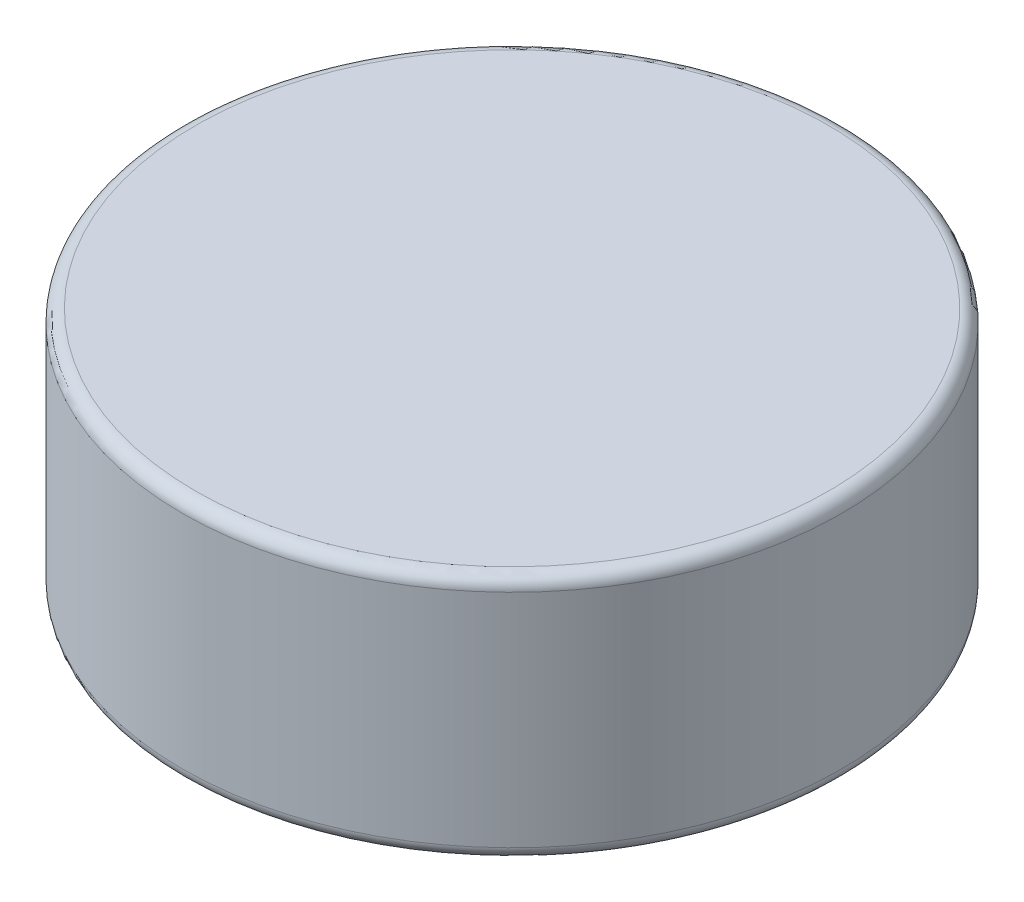
ISO-10303-21;
HEADER;
FILE_DESCRIPTION(('STEP AP214'),'2;1');
FILE_NAME('part.step','',(''),(''),'','','');
FILE_SCHEMA(('AUTOMOTIVE_DESIGN { 1 0 10303 214 1 1 1 1 }'));
ENDSEC;
DATA;
#1=APPLICATION_CONTEXT('core data for automotive mechanical design processes');
#2=APPLICATION_PROTOCOL_DEFINITION('international standard','automotive_design',2000,#1);
#3=PRODUCT_CONTEXT('',#1,'mechanical');
#4=PRODUCT('Part','Part','',(#3));
#5=PRODUCT_RELATED_PRODUCT_CATEGORY('part','',(#4));
#6=PRODUCT_DEFINITION_FORMATION('','',#4);
#7=PRODUCT_DEFINITION_CONTEXT('part definition',#1,'design');
#8=PRODUCT_DEFINITION('design','',#6,#7);
#9=PRODUCT_DEFINITION_SHAPE('','',#8);
#10=(LENGTH_UNIT() NAMED_UNIT(*) SI_UNIT(.MILLI.,.METRE.));
#11=(NAMED_UNIT(*) PLANE_ANGLE_UNIT() SI_UNIT($,.RADIAN.));
#12=(NAMED_UNIT(*) SI_UNIT($,.STERADIAN.) SOLID_ANGLE_UNIT());
#13=UNCERTAINTY_MEASURE_WITH_UNIT(LENGTH_MEASURE(1.E-05),#10,'distance_accuracy_value','');
#14=(GEOMETRIC_REPRESENTATION_CONTEXT(3) GLOBAL_UNCERTAINTY_ASSIGNED_CONTEXT((#13)) GLOBAL_UNIT_ASSIGNED_CONTEXT((#10,
#11,#12)) REPRESENTATION_CONTEXT('',''));
#15=CARTESIAN_POINT('',(0.,0.,0.));
#16=DIRECTION('',(0.,0.,1.));
#17=DIRECTION('',(1.,0.,0.));
#18=AXIS2_PLACEMENT_3D('',#15,#16,#17);
#19=CARTESIAN_POINT('',(0.,4.7625,0.));
#20=DIRECTION('',(0.,-1.,0.));
#21=DIRECTION('',(0.,0.,-1.));
#22=AXIS2_PLACEMENT_3D('',#19,#20,#21);
#23=CYLINDRICAL_SURFACE('',#22,12.7);
#24=CARTESIAN_POINT('',(0.,-4.2625,0.));
#25=DIRECTION('',(0.,1.,0.));
#26=DIRECTION('',(0.,0.,1.));
#27=AXIS2_PLACEMENT_3D('',#24,#25,#26);
#28=CIRCLE('',#27,12.7);
#29=CARTESIAN_POINT('',(0.,-4.2625,12.7));
#30=VERTEX_POINT('',#29);
#31=EDGE_CURVE('E54',#30,#30,#28,.T.);
#32=ORIENTED_EDGE('',*,*,#31,.T.);
#33=EDGE_LOOP('',(#32));
#34=FACE_BOUND('',#33,.T.);
#35=CARTESIAN_POINT('',(0.,4.2625,0.));
#36=DIRECTION('',(0.,1.,0.));
#37=DIRECTION('',(0.,0.,1.));
#38=AXIS2_PLACEMENT_3D('',#35,#36,#37);
#39=CIRCLE('',#38,12.7);
#40=CARTESIAN_POINT('',(0.,4.2625,12.7));
#41=VERTEX_POINT('',#40);
#42=EDGE_CURVE('E59',#41,#41,#39,.F.);
#43=ORIENTED_EDGE('',*,*,#42,.T.);
#44=EDGE_LOOP('',(#43));
#45=FACE_BOUND('',#44,.T.);
#46=ADVANCED_FACE('F41',(#34,#45),#23,.T.);
#47=CARTESIAN_POINT('',(0.,4.7625,0.));
#48=DIRECTION('',(0.,1.,0.));
#49=DIRECTION('',(0.,0.,1.));
#50=AXIS2_PLACEMENT_3D('',#47,#48,#49);
#51=PLANE('',#50);
#52=CARTESIAN_POINT('',(0.,4.7625,0.));
#53=DIRECTION('',(0.,1.,0.));
#54=DIRECTION('',(0.,0.,1.));
#55=AXIS2_PLACEMENT_3D('',#52,#53,#54);
#56=CIRCLE('',#55,12.2);
#57=CARTESIAN_POINT('',(0.,4.7625,12.2));
#58=VERTEX_POINT('',#57);
#59=EDGE_CURVE('E10',#58,#58,#56,.T.);
#60=ORIENTED_EDGE('',*,*,#59,.T.);
#61=EDGE_LOOP('',(#60));
#62=FACE_BOUND('',#61,.T.);
#63=ADVANCED_FACE('F76',(#62),#51,.T.);
#64=CARTESIAN_POINT('',(0.,-4.7625,0.));
#65=DIRECTION('',(0.,1.,0.));
#66=DIRECTION('',(0.,0.,1.));
#67=AXIS2_PLACEMENT_3D('',#64,#65,#66);
#68=PLANE('',#67);
#69=CARTESIAN_POINT('',(0.,-4.7625,0.));
#70=DIRECTION('',(0.,1.,0.));
#71=DIRECTION('',(0.,0.,1.));
#72=AXIS2_PLACEMENT_3D('',#69,#70,#71);
#73=CIRCLE('',#72,12.2);
#74=CARTESIAN_POINT('',(0.,-4.7625,12.2));
#75=VERTEX_POINT('',#74);
#76=EDGE_CURVE('E49',#75,#75,#73,.F.);
#77=ORIENTED_EDGE('',*,*,#76,.T.);
#78=EDGE_LOOP('',(#77));
#79=FACE_BOUND('',#78,.T.);
#80=ADVANCED_FACE('F73',(#79),#68,.F.);
#81=CARTESIAN_POINT('',(0.,-4.2625,0.));
#82=DIRECTION('',(0.,1.,0.));
#83=DIRECTION('',(0.,0.,1.));
#84=AXIS2_PLACEMENT_3D('',#81,#82,#83);
#85=TOROIDAL_SURFACE('',#84,12.2,0.5);
#86=ORIENTED_EDGE('',*,*,#76,.F.);
#87=EDGE_LOOP('',(#86));
#88=FACE_BOUND('',#87,.T.);
#89=ORIENTED_EDGE('',*,*,#31,.F.);
#90=EDGE_LOOP('',(#89));
#91=FACE_BOUND('',#90,.T.);
#92=ADVANCED_FACE('F69',(#88,#91),#85,.T.);
#93=CARTESIAN_POINT('',(0.,4.2625,0.));
#94=DIRECTION('',(0.,1.,0.));
#95=DIRECTION('',(0.,0.,1.));
#96=AXIS2_PLACEMENT_3D('',#93,#94,#95);
#97=TOROIDAL_SURFACE('',#96,12.2,0.5);
#98=ORIENTED_EDGE('',*,*,#42,.F.);
#99=EDGE_LOOP('',(#98));
#100=FACE_BOUND('',#99,.T.);
#101=ORIENTED_EDGE('',*,*,#59,.F.);
#102=EDGE_LOOP('',(#101));
#103=FACE_BOUND('',#102,.T.);
#104=ADVANCED_FACE('F43',(#100,#103),#97,.T.);
#105=CLOSED_SHELL('',(#46,#63,#80,#92,#104));
#106=MANIFOLD_SOLID_BREP('B2',#105);
#107=ADVANCED_BREP_SHAPE_REPRESENTATION('',(#18,#106),#14);
#108=SHAPE_DEFINITION_REPRESENTATION(#9,#107);
ENDSEC;
END-ISO-10303-21;
